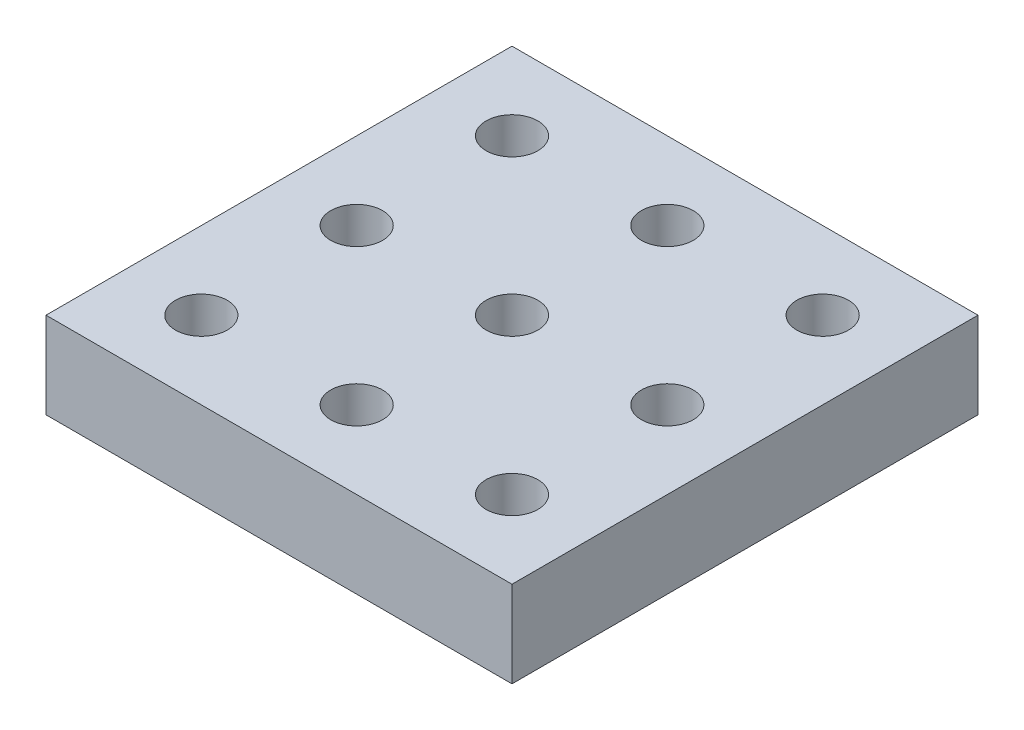
ISO-10303-21;
HEADER;
FILE_DESCRIPTION(('STEP AP214'),'2;1');
FILE_NAME('part.step','',(''),(''),'','','');
FILE_SCHEMA(('AUTOMOTIVE_DESIGN { 1 0 10303 214 1 1 1 1 }'));
ENDSEC;
DATA;
#1=APPLICATION_CONTEXT('core data for automotive mechanical design processes');
#2=APPLICATION_PROTOCOL_DEFINITION('international standard','automotive_design',2000,#1);
#3=PRODUCT_CONTEXT('',#1,'mechanical');
#4=PRODUCT('Part','Part','',(#3));
#5=PRODUCT_RELATED_PRODUCT_CATEGORY('part','',(#4));
#6=PRODUCT_DEFINITION_FORMATION('','',#4);
#7=PRODUCT_DEFINITION_CONTEXT('part definition',#1,'design');
#8=PRODUCT_DEFINITION('design','',#6,#7);
#9=PRODUCT_DEFINITION_SHAPE('','',#8);
#10=(LENGTH_UNIT() NAMED_UNIT(*) SI_UNIT(.MILLI.,.METRE.));
#11=(NAMED_UNIT(*) PLANE_ANGLE_UNIT() SI_UNIT($,.RADIAN.));
#12=(NAMED_UNIT(*) SI_UNIT($,.STERADIAN.) SOLID_ANGLE_UNIT());
#13=UNCERTAINTY_MEASURE_WITH_UNIT(LENGTH_MEASURE(1.E-05),#10,'distance_accuracy_value','');
#14=(GEOMETRIC_REPRESENTATION_CONTEXT(3) GLOBAL_UNCERTAINTY_ASSIGNED_CONTEXT((#13)) GLOBAL_UNIT_ASSIGNED_CONTEXT((#10,
#11,#12)) REPRESENTATION_CONTEXT('',''));
#15=CARTESIAN_POINT('',(0.,0.,0.));
#16=DIRECTION('',(0.,0.,1.));
#17=DIRECTION('',(1.,0.,0.));
#18=AXIS2_PLACEMENT_3D('',#15,#16,#17);
#19=CARTESIAN_POINT('',(0.,10.,-27.));
#20=DIRECTION('',(0.,0.,1.));
#21=DIRECTION('',(1.,0.,0.));
#22=AXIS2_PLACEMENT_3D('',#19,#20,#21);
#23=PLANE('',#22);
#24=DIRECTION('',(-1.,0.,0.));
#25=VECTOR('',#24,1.);
#26=CARTESIAN_POINT('',(0.,0.,-27.));
#27=LINE('',#26,#25);
#28=CARTESIAN_POINT('',(27.,0.,-27.));
#29=VERTEX_POINT('',#28);
#30=CARTESIAN_POINT('',(-27.,0.,-27.));
#31=VERTEX_POINT('',#30);
#32=EDGE_CURVE('E126',#29,#31,#27,.T.);
#33=ORIENTED_EDGE('',*,*,#32,.T.);
#34=DIRECTION('',(0.,-1.,0.));
#35=VECTOR('',#34,1.);
#36=CARTESIAN_POINT('',(-27.,10.,-27.));
#37=LINE('',#36,#35);
#38=CARTESIAN_POINT('',(-27.,10.,-27.));
#39=VERTEX_POINT('',#38);
#40=EDGE_CURVE('E11',#39,#31,#37,.T.);
#41=ORIENTED_EDGE('',*,*,#40,.F.);
#42=DIRECTION('',(-1.,0.,0.));
#43=VECTOR('',#42,1.);
#44=CARTESIAN_POINT('',(0.,10.,-27.));
#45=LINE('',#44,#43);
#46=CARTESIAN_POINT('',(27.,10.,-27.));
#47=VERTEX_POINT('',#46);
#48=EDGE_CURVE('E85',#47,#39,#45,.T.);
#49=ORIENTED_EDGE('',*,*,#48,.F.);
#50=DIRECTION('',(0.,-1.,0.));
#51=VECTOR('',#50,1.);
#52=CARTESIAN_POINT('',(27.,10.,-27.));
#53=LINE('',#52,#51);
#54=EDGE_CURVE('E52',#47,#29,#53,.T.);
#55=ORIENTED_EDGE('',*,*,#54,.T.);
#56=EDGE_LOOP('',(#33,#41,#49,#55));
#57=FACE_BOUND('',#56,.T.);
#58=ADVANCED_FACE('F35',(#57),#23,.F.);
#59=CARTESIAN_POINT('',(-27.,10.,0.));
#60=DIRECTION('',(1.,0.,0.));
#61=DIRECTION('',(0.,0.,-1.));
#62=AXIS2_PLACEMENT_3D('',#59,#60,#61);
#63=PLANE('',#62);
#64=DIRECTION('',(0.,0.,1.));
#65=VECTOR('',#64,1.);
#66=CARTESIAN_POINT('',(-27.,0.,0.));
#67=LINE('',#66,#65);
#68=CARTESIAN_POINT('',(-27.,0.,27.));
#69=VERTEX_POINT('',#68);
#70=EDGE_CURVE('E90',#31,#69,#67,.T.);
#71=ORIENTED_EDGE('',*,*,#70,.T.);
#72=DIRECTION('',(0.,-1.,0.));
#73=VECTOR('',#72,1.);
#74=CARTESIAN_POINT('',(-27.,10.,27.));
#75=LINE('',#74,#73);
#76=CARTESIAN_POINT('',(-27.,10.,27.));
#77=VERTEX_POINT('',#76);
#78=EDGE_CURVE('E44',#77,#69,#75,.T.);
#79=ORIENTED_EDGE('',*,*,#78,.F.);
#80=DIRECTION('',(0.,0.,1.));
#81=VECTOR('',#80,1.);
#82=CARTESIAN_POINT('',(-27.,10.,0.));
#83=LINE('',#82,#81);
#84=EDGE_CURVE('E77',#39,#77,#83,.T.);
#85=ORIENTED_EDGE('',*,*,#84,.F.);
#86=ORIENTED_EDGE('',*,*,#40,.T.);
#87=EDGE_LOOP('',(#71,#79,#85,#86));
#88=FACE_BOUND('',#87,.T.);
#89=ADVANCED_FACE('F89',(#88),#63,.F.);
#90=CARTESIAN_POINT('',(0.,10.,27.));
#91=DIRECTION('',(0.,0.,1.));
#92=DIRECTION('',(1.,0.,0.));
#93=AXIS2_PLACEMENT_3D('',#90,#91,#92);
#94=PLANE('',#93);
#95=DIRECTION('',(-1.,0.,0.));
#96=VECTOR('',#95,1.);
#97=CARTESIAN_POINT('',(0.,0.,27.));
#98=LINE('',#97,#96);
#99=CARTESIAN_POINT('',(27.,0.,27.));
#100=VERTEX_POINT('',#99);
#101=EDGE_CURVE('E129',#100,#69,#98,.T.);
#102=ORIENTED_EDGE('',*,*,#101,.F.);
#103=DIRECTION('',(0.,-1.,0.));
#104=VECTOR('',#103,1.);
#105=CARTESIAN_POINT('',(27.,10.,27.));
#106=LINE('',#105,#104);
#107=CARTESIAN_POINT('',(27.,10.,27.));
#108=VERTEX_POINT('',#107);
#109=EDGE_CURVE('E66',#108,#100,#106,.T.);
#110=ORIENTED_EDGE('',*,*,#109,.F.);
#111=DIRECTION('',(-1.,0.,0.));
#112=VECTOR('',#111,1.);
#113=CARTESIAN_POINT('',(0.,10.,27.));
#114=LINE('',#113,#112);
#115=EDGE_CURVE('E84',#108,#77,#114,.T.);
#116=ORIENTED_EDGE('',*,*,#115,.T.);
#117=ORIENTED_EDGE('',*,*,#78,.T.);
#118=EDGE_LOOP('',(#102,#110,#116,#117));
#119=FACE_BOUND('',#118,.T.);
#120=ADVANCED_FACE('F93',(#119),#94,.T.);
#121=CARTESIAN_POINT('',(0.,10.,0.));
#122=DIRECTION('',(0.,-1.,0.));
#123=DIRECTION('',(0.,0.,-1.));
#124=AXIS2_PLACEMENT_3D('',#121,#122,#123);
#125=CYLINDRICAL_SURFACE('',#124,3.);
#126=CARTESIAN_POINT('',(0.,10.,0.));
#127=DIRECTION('',(0.,1.,0.));
#128=DIRECTION('',(0.,0.,1.));
#129=AXIS2_PLACEMENT_3D('',#126,#127,#128);
#130=CIRCLE('',#129,3.);
#131=CARTESIAN_POINT('',(0.,10.,3.));
#132=VERTEX_POINT('',#131);
#133=EDGE_CURVE('E163',#132,#132,#130,.T.);
#134=ORIENTED_EDGE('',*,*,#133,.T.);
#135=EDGE_LOOP('',(#134));
#136=FACE_BOUND('',#135,.T.);
#137=CARTESIAN_POINT('',(0.,0.,0.));
#138=DIRECTION('',(0.,1.,0.));
#139=DIRECTION('',(0.,0.,1.));
#140=AXIS2_PLACEMENT_3D('',#137,#138,#139);
#141=CIRCLE('',#140,3.);
#142=CARTESIAN_POINT('',(0.,0.,3.));
#143=VERTEX_POINT('',#142);
#144=EDGE_CURVE('E123',#143,#143,#141,.T.);
#145=ORIENTED_EDGE('',*,*,#144,.F.);
#146=EDGE_LOOP('',(#145));
#147=FACE_BOUND('',#146,.T.);
#148=ADVANCED_FACE('F167',(#136,#147),#125,.F.);
#149=CARTESIAN_POINT('',(-18.,10.,0.));
#150=DIRECTION('',(0.,-1.,0.));
#151=DIRECTION('',(0.,0.,-1.));
#152=AXIS2_PLACEMENT_3D('',#149,#150,#151);
#153=CYLINDRICAL_SURFACE('',#152,3.);
#154=CARTESIAN_POINT('',(-18.,10.,0.));
#155=DIRECTION('',(0.,1.,0.));
#156=DIRECTION('',(0.,0.,1.));
#157=AXIS2_PLACEMENT_3D('',#154,#155,#156);
#158=CIRCLE('',#157,3.);
#159=CARTESIAN_POINT('',(-18.,10.,3.));
#160=VERTEX_POINT('',#159);
#161=EDGE_CURVE('E160',#160,#160,#158,.T.);
#162=ORIENTED_EDGE('',*,*,#161,.T.);
#163=EDGE_LOOP('',(#162));
#164=FACE_BOUND('',#163,.T.);
#165=CARTESIAN_POINT('',(-18.,0.,0.));
#166=DIRECTION('',(0.,1.,0.));
#167=DIRECTION('',(0.,0.,1.));
#168=AXIS2_PLACEMENT_3D('',#165,#166,#167);
#169=CIRCLE('',#168,3.);
#170=CARTESIAN_POINT('',(-18.,0.,3.));
#171=VERTEX_POINT('',#170);
#172=EDGE_CURVE('E120',#171,#171,#169,.T.);
#173=ORIENTED_EDGE('',*,*,#172,.F.);
#174=EDGE_LOOP('',(#173));
#175=FACE_BOUND('',#174,.T.);
#176=ADVANCED_FACE('F193',(#164,#175),#153,.F.);
#177=CARTESIAN_POINT('',(-18.,10.,-18.));
#178=DIRECTION('',(0.,-1.,0.));
#179=DIRECTION('',(0.,0.,-1.));
#180=AXIS2_PLACEMENT_3D('',#177,#178,#179);
#181=CYLINDRICAL_SURFACE('',#180,3.);
#182=CARTESIAN_POINT('',(-18.,10.,-18.));
#183=DIRECTION('',(0.,1.,0.));
#184=DIRECTION('',(0.,0.,1.));
#185=AXIS2_PLACEMENT_3D('',#182,#183,#184);
#186=CIRCLE('',#185,3.);
#187=CARTESIAN_POINT('',(-18.,10.,-15.));
#188=VERTEX_POINT('',#187);
#189=EDGE_CURVE('E157',#188,#188,#186,.T.);
#190=ORIENTED_EDGE('',*,*,#189,.T.);
#191=EDGE_LOOP('',(#190));
#192=FACE_BOUND('',#191,.T.);
#193=CARTESIAN_POINT('',(-18.,0.,-18.));
#194=DIRECTION('',(0.,1.,0.));
#195=DIRECTION('',(0.,0.,1.));
#196=AXIS2_PLACEMENT_3D('',#193,#194,#195);
#197=CIRCLE('',#196,3.);
#198=CARTESIAN_POINT('',(-18.,0.,-15.));
#199=VERTEX_POINT('',#198);
#200=EDGE_CURVE('E117',#199,#199,#197,.T.);
#201=ORIENTED_EDGE('',*,*,#200,.F.);
#202=EDGE_LOOP('',(#201));
#203=FACE_BOUND('',#202,.T.);
#204=ADVANCED_FACE('F196',(#192,#203),#181,.F.);
#205=CARTESIAN_POINT('',(0.,10.,-18.));
#206=DIRECTION('',(0.,-1.,0.));
#207=DIRECTION('',(0.,0.,-1.));
#208=AXIS2_PLACEMENT_3D('',#205,#206,#207);
#209=CYLINDRICAL_SURFACE('',#208,3.);
#210=CARTESIAN_POINT('',(0.,10.,-18.));
#211=DIRECTION('',(0.,1.,0.));
#212=DIRECTION('',(0.,0.,1.));
#213=AXIS2_PLACEMENT_3D('',#210,#211,#212);
#214=CIRCLE('',#213,3.);
#215=CARTESIAN_POINT('',(0.,10.,-15.));
#216=VERTEX_POINT('',#215);
#217=EDGE_CURVE('E154',#216,#216,#214,.T.);
#218=ORIENTED_EDGE('',*,*,#217,.T.);
#219=EDGE_LOOP('',(#218));
#220=FACE_BOUND('',#219,.T.);
#221=CARTESIAN_POINT('',(0.,0.,-18.));
#222=DIRECTION('',(0.,1.,0.));
#223=DIRECTION('',(0.,0.,1.));
#224=AXIS2_PLACEMENT_3D('',#221,#222,#223);
#225=CIRCLE('',#224,3.);
#226=CARTESIAN_POINT('',(0.,0.,-15.));
#227=VERTEX_POINT('',#226);
#228=EDGE_CURVE('E114',#227,#227,#225,.T.);
#229=ORIENTED_EDGE('',*,*,#228,.F.);
#230=EDGE_LOOP('',(#229));
#231=FACE_BOUND('',#230,.T.);
#232=ADVANCED_FACE('F200',(#220,#231),#209,.F.);
#233=CARTESIAN_POINT('',(18.,10.,-18.));
#234=DIRECTION('',(0.,-1.,0.));
#235=DIRECTION('',(0.,0.,-1.));
#236=AXIS2_PLACEMENT_3D('',#233,#234,#235);
#237=CYLINDRICAL_SURFACE('',#236,3.00000000000001);
#238=CARTESIAN_POINT('',(18.,10.,-18.));
#239=DIRECTION('',(0.,1.,0.));
#240=DIRECTION('',(0.,0.,1.));
#241=AXIS2_PLACEMENT_3D('',#238,#239,#240);
#242=CIRCLE('',#241,3.00000000000001);
#243=CARTESIAN_POINT('',(18.,10.,-15.));
#244=VERTEX_POINT('',#243);
#245=EDGE_CURVE('E151',#244,#244,#242,.T.);
#246=ORIENTED_EDGE('',*,*,#245,.T.);
#247=EDGE_LOOP('',(#246));
#248=FACE_BOUND('',#247,.T.);
#249=CARTESIAN_POINT('',(18.,0.,-18.));
#250=DIRECTION('',(0.,1.,0.));
#251=DIRECTION('',(0.,0.,1.));
#252=AXIS2_PLACEMENT_3D('',#249,#250,#251);
#253=CIRCLE('',#252,3.00000000000001);
#254=CARTESIAN_POINT('',(18.,0.,-15.));
#255=VERTEX_POINT('',#254);
#256=EDGE_CURVE('E111',#255,#255,#253,.T.);
#257=ORIENTED_EDGE('',*,*,#256,.F.);
#258=EDGE_LOOP('',(#257));
#259=FACE_BOUND('',#258,.T.);
#260=ADVANCED_FACE('F204',(#248,#259),#237,.F.);
#261=CARTESIAN_POINT('',(18.,10.,0.));
#262=DIRECTION('',(0.,-1.,0.));
#263=DIRECTION('',(0.,0.,-1.));
#264=AXIS2_PLACEMENT_3D('',#261,#262,#263);
#265=CYLINDRICAL_SURFACE('',#264,3.00000000000001);
#266=CARTESIAN_POINT('',(18.,10.,0.));
#267=DIRECTION('',(0.,1.,0.));
#268=DIRECTION('',(0.,0.,1.));
#269=AXIS2_PLACEMENT_3D('',#266,#267,#268);
#270=CIRCLE('',#269,3.00000000000001);
#271=CARTESIAN_POINT('',(18.,10.,3.00000000000001));
#272=VERTEX_POINT('',#271);
#273=EDGE_CURVE('E148',#272,#272,#270,.T.);
#274=ORIENTED_EDGE('',*,*,#273,.T.);
#275=EDGE_LOOP('',(#274));
#276=FACE_BOUND('',#275,.T.);
#277=CARTESIAN_POINT('',(18.,0.,0.));
#278=DIRECTION('',(0.,1.,0.));
#279=DIRECTION('',(0.,0.,1.));
#280=AXIS2_PLACEMENT_3D('',#277,#278,#279);
#281=CIRCLE('',#280,3.00000000000001);
#282=CARTESIAN_POINT('',(18.,0.,3.00000000000001));
#283=VERTEX_POINT('',#282);
#284=EDGE_CURVE('E108',#283,#283,#281,.T.);
#285=ORIENTED_EDGE('',*,*,#284,.F.);
#286=EDGE_LOOP('',(#285));
#287=FACE_BOUND('',#286,.T.);
#288=ADVANCED_FACE('F208',(#276,#287),#265,.F.);
#289=CARTESIAN_POINT('',(18.,10.,18.));
#290=DIRECTION('',(0.,-1.,0.));
#291=DIRECTION('',(0.,0.,-1.));
#292=AXIS2_PLACEMENT_3D('',#289,#290,#291);
#293=CYLINDRICAL_SURFACE('',#292,3.00000000000001);
#294=CARTESIAN_POINT('',(18.,10.,18.));
#295=DIRECTION('',(0.,1.,0.));
#296=DIRECTION('',(0.,0.,1.));
#297=AXIS2_PLACEMENT_3D('',#294,#295,#296);
#298=CIRCLE('',#297,3.00000000000001);
#299=CARTESIAN_POINT('',(18.,10.,21.));
#300=VERTEX_POINT('',#299);
#301=EDGE_CURVE('E143',#300,#300,#298,.T.);
#302=ORIENTED_EDGE('',*,*,#301,.T.);
#303=EDGE_LOOP('',(#302));
#304=FACE_BOUND('',#303,.T.);
#305=CARTESIAN_POINT('',(18.,0.,18.));
#306=DIRECTION('',(0.,1.,0.));
#307=DIRECTION('',(0.,0.,1.));
#308=AXIS2_PLACEMENT_3D('',#305,#306,#307);
#309=CIRCLE('',#308,3.00000000000001);
#310=CARTESIAN_POINT('',(18.,0.,21.));
#311=VERTEX_POINT('',#310);
#312=EDGE_CURVE('E105',#311,#311,#309,.T.);
#313=ORIENTED_EDGE('',*,*,#312,.F.);
#314=EDGE_LOOP('',(#313));
#315=FACE_BOUND('',#314,.T.);
#316=ADVANCED_FACE('F212',(#304,#315),#293,.F.);
#317=CARTESIAN_POINT('',(0.,10.,18.));
#318=DIRECTION('',(0.,-1.,0.));
#319=DIRECTION('',(0.,0.,-1.));
#320=AXIS2_PLACEMENT_3D('',#317,#318,#319);
#321=CYLINDRICAL_SURFACE('',#320,3.);
#322=CARTESIAN_POINT('',(0.,10.,18.));
#323=DIRECTION('',(0.,1.,0.));
#324=DIRECTION('',(0.,0.,1.));
#325=AXIS2_PLACEMENT_3D('',#322,#323,#324);
#326=CIRCLE('',#325,3.);
#327=CARTESIAN_POINT('',(0.,10.,21.));
#328=VERTEX_POINT('',#327);
#329=EDGE_CURVE('E138',#328,#328,#326,.T.);
#330=ORIENTED_EDGE('',*,*,#329,.T.);
#331=EDGE_LOOP('',(#330));
#332=FACE_BOUND('',#331,.T.);
#333=CARTESIAN_POINT('',(0.,0.,18.));
#334=DIRECTION('',(0.,1.,0.));
#335=DIRECTION('',(0.,0.,1.));
#336=AXIS2_PLACEMENT_3D('',#333,#334,#335);
#337=CIRCLE('',#336,3.);
#338=CARTESIAN_POINT('',(0.,0.,21.));
#339=VERTEX_POINT('',#338);
#340=EDGE_CURVE('E102',#339,#339,#337,.T.);
#341=ORIENTED_EDGE('',*,*,#340,.F.);
#342=EDGE_LOOP('',(#341));
#343=FACE_BOUND('',#342,.T.);
#344=ADVANCED_FACE('F215',(#332,#343),#321,.F.);
#345=CARTESIAN_POINT('',(-18.,10.,18.));
#346=DIRECTION('',(0.,-1.,0.));
#347=DIRECTION('',(0.,0.,-1.));
#348=AXIS2_PLACEMENT_3D('',#345,#346,#347);
#349=CYLINDRICAL_SURFACE('',#348,3.);
#350=CARTESIAN_POINT('',(-18.,10.,18.));
#351=DIRECTION('',(0.,1.,0.));
#352=DIRECTION('',(0.,0.,1.));
#353=AXIS2_PLACEMENT_3D('',#350,#351,#352);
#354=CIRCLE('',#353,3.);
#355=CARTESIAN_POINT('',(-18.,10.,21.));
#356=VERTEX_POINT('',#355);
#357=EDGE_CURVE('E134',#356,#356,#354,.T.);
#358=ORIENTED_EDGE('',*,*,#357,.T.);
#359=EDGE_LOOP('',(#358));
#360=FACE_BOUND('',#359,.T.);
#361=CARTESIAN_POINT('',(-18.,0.,18.));
#362=DIRECTION('',(0.,1.,0.));
#363=DIRECTION('',(0.,0.,1.));
#364=AXIS2_PLACEMENT_3D('',#361,#362,#363);
#365=CIRCLE('',#364,3.);
#366=CARTESIAN_POINT('',(-18.,0.,21.));
#367=VERTEX_POINT('',#366);
#368=EDGE_CURVE('E99',#367,#367,#365,.T.);
#369=ORIENTED_EDGE('',*,*,#368,.F.);
#370=EDGE_LOOP('',(#369));
#371=FACE_BOUND('',#370,.T.);
#372=ADVANCED_FACE('F37',(#360,#371),#349,.F.);
#373=CARTESIAN_POINT('',(27.,10.,0.));
#374=DIRECTION('',(1.,0.,0.));
#375=DIRECTION('',(0.,0.,-1.));
#376=AXIS2_PLACEMENT_3D('',#373,#374,#375);
#377=PLANE('',#376);
#378=DIRECTION('',(0.,0.,1.));
#379=VECTOR('',#378,1.);
#380=CARTESIAN_POINT('',(27.,0.,0.));
#381=LINE('',#380,#379);
#382=EDGE_CURVE('E131',#29,#100,#381,.T.);
#383=ORIENTED_EDGE('',*,*,#382,.F.);
#384=ORIENTED_EDGE('',*,*,#54,.F.);
#385=DIRECTION('',(0.,0.,1.));
#386=VECTOR('',#385,1.);
#387=CARTESIAN_POINT('',(27.,10.,0.));
#388=LINE('',#387,#386);
#389=EDGE_CURVE('E94',#47,#108,#388,.T.);
#390=ORIENTED_EDGE('',*,*,#389,.T.);
#391=ORIENTED_EDGE('',*,*,#109,.T.);
#392=EDGE_LOOP('',(#383,#384,#390,#391));
#393=FACE_BOUND('',#392,.T.);
#394=ADVANCED_FACE('F172',(#393),#377,.T.);
#395=CARTESIAN_POINT('',(0.,10.,0.));
#396=DIRECTION('',(0.,1.,0.));
#397=DIRECTION('',(0.,0.,1.));
#398=AXIS2_PLACEMENT_3D('',#395,#396,#397);
#399=PLANE('',#398);
#400=ORIENTED_EDGE('',*,*,#357,.F.);
#401=EDGE_LOOP('',(#400));
#402=FACE_BOUND('',#401,.T.);
#403=ORIENTED_EDGE('',*,*,#329,.F.);
#404=EDGE_LOOP('',(#403));
#405=FACE_BOUND('',#404,.T.);
#406=ORIENTED_EDGE('',*,*,#301,.F.);
#407=EDGE_LOOP('',(#406));
#408=FACE_BOUND('',#407,.T.);
#409=ORIENTED_EDGE('',*,*,#273,.F.);
#410=EDGE_LOOP('',(#409));
#411=FACE_BOUND('',#410,.T.);
#412=ORIENTED_EDGE('',*,*,#245,.F.);
#413=EDGE_LOOP('',(#412));
#414=FACE_BOUND('',#413,.T.);
#415=ORIENTED_EDGE('',*,*,#217,.F.);
#416=EDGE_LOOP('',(#415));
#417=FACE_BOUND('',#416,.T.);
#418=ORIENTED_EDGE('',*,*,#189,.F.);
#419=EDGE_LOOP('',(#418));
#420=FACE_BOUND('',#419,.T.);
#421=ORIENTED_EDGE('',*,*,#161,.F.);
#422=EDGE_LOOP('',(#421));
#423=FACE_BOUND('',#422,.T.);
#424=ORIENTED_EDGE('',*,*,#133,.F.);
#425=EDGE_LOOP('',(#424));
#426=FACE_BOUND('',#425,.T.);
#427=ORIENTED_EDGE('',*,*,#48,.T.);
#428=ORIENTED_EDGE('',*,*,#84,.T.);
#429=ORIENTED_EDGE('',*,*,#115,.F.);
#430=ORIENTED_EDGE('',*,*,#389,.F.);
#431=EDGE_LOOP('',(#427,#428,#429,#430));
#432=FACE_BOUND('',#431,.T.);
#433=ADVANCED_FACE('F81',(#402,#405,#408,#411,#414,#417,#420,#423,#426,#432),#399,.T.);
#434=CARTESIAN_POINT('',(0.,0.,0.));
#435=DIRECTION('',(0.,1.,0.));
#436=DIRECTION('',(0.,0.,1.));
#437=AXIS2_PLACEMENT_3D('',#434,#435,#436);
#438=PLANE('',#437);
#439=ORIENTED_EDGE('',*,*,#368,.T.);
#440=EDGE_LOOP('',(#439));
#441=FACE_BOUND('',#440,.T.);
#442=ORIENTED_EDGE('',*,*,#340,.T.);
#443=EDGE_LOOP('',(#442));
#444=FACE_BOUND('',#443,.T.);
#445=ORIENTED_EDGE('',*,*,#312,.T.);
#446=EDGE_LOOP('',(#445));
#447=FACE_BOUND('',#446,.T.);
#448=ORIENTED_EDGE('',*,*,#284,.T.);
#449=EDGE_LOOP('',(#448));
#450=FACE_BOUND('',#449,.T.);
#451=ORIENTED_EDGE('',*,*,#256,.T.);
#452=EDGE_LOOP('',(#451));
#453=FACE_BOUND('',#452,.T.);
#454=ORIENTED_EDGE('',*,*,#228,.T.);
#455=EDGE_LOOP('',(#454));
#456=FACE_BOUND('',#455,.T.);
#457=ORIENTED_EDGE('',*,*,#200,.T.);
#458=EDGE_LOOP('',(#457));
#459=FACE_BOUND('',#458,.T.);
#460=ORIENTED_EDGE('',*,*,#172,.T.);
#461=EDGE_LOOP('',(#460));
#462=FACE_BOUND('',#461,.T.);
#463=ORIENTED_EDGE('',*,*,#144,.T.);
#464=EDGE_LOOP('',(#463));
#465=FACE_BOUND('',#464,.T.);
#466=ORIENTED_EDGE('',*,*,#32,.F.);
#467=ORIENTED_EDGE('',*,*,#382,.T.);
#468=ORIENTED_EDGE('',*,*,#101,.T.);
#469=ORIENTED_EDGE('',*,*,#70,.F.);
#470=EDGE_LOOP('',(#466,#467,#468,#469));
#471=FACE_BOUND('',#470,.T.);
#472=ADVANCED_FACE('F171',(#441,#444,#447,#450,#453,#456,#459,#462,#465,#471),#438,.F.);
#473=CLOSED_SHELL('',(#58,#89,#120,#148,#176,#204,#232,#260,#288,#316,#344,#372,#394,#433,#472));
#474=MANIFOLD_SOLID_BREP('B2',#473);
#475=ADVANCED_BREP_SHAPE_REPRESENTATION('',(#18,#474),#14);
#476=SHAPE_DEFINITION_REPRESENTATION(#9,#475);
ENDSEC;
END-ISO-10303-21;
